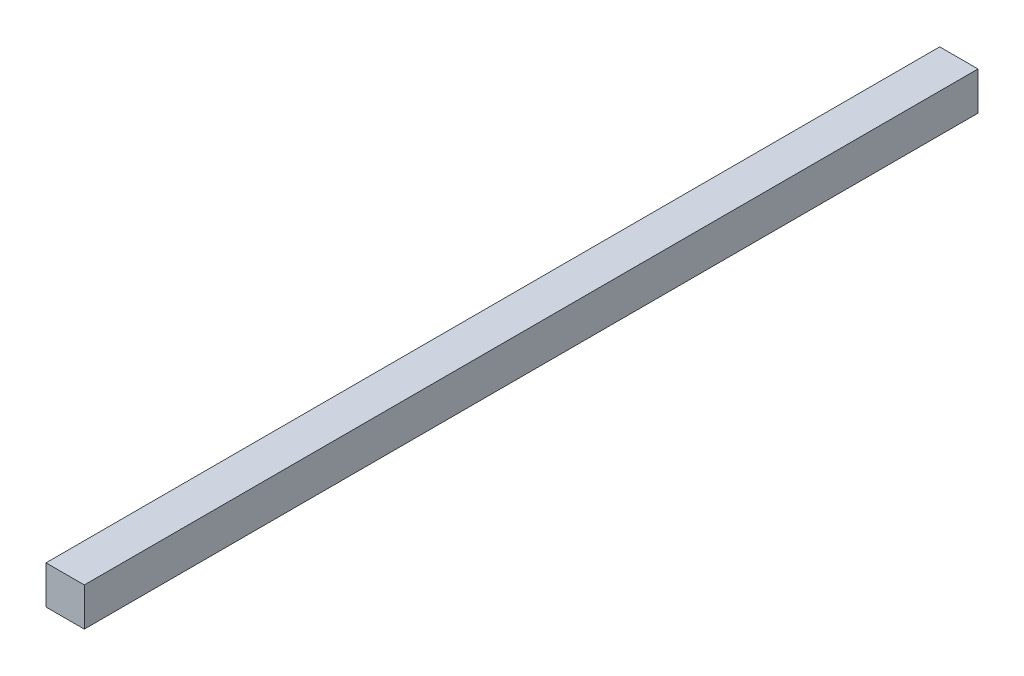
ISO-10303-21;
HEADER;
FILE_DESCRIPTION(('STEP AP214'),'2;1');
FILE_NAME('part.step','',(''),(''),'','','');
FILE_SCHEMA(('AUTOMOTIVE_DESIGN { 1 0 10303 214 1 1 1 1 }'));
ENDSEC;
DATA;
#1=APPLICATION_CONTEXT('core data for automotive mechanical design processes');
#2=APPLICATION_PROTOCOL_DEFINITION('international standard','automotive_design',2000,#1);
#3=PRODUCT_CONTEXT('',#1,'mechanical');
#4=PRODUCT('Part','Part','',(#3));
#5=PRODUCT_RELATED_PRODUCT_CATEGORY('part','',(#4));
#6=PRODUCT_DEFINITION_FORMATION('','',#4);
#7=PRODUCT_DEFINITION_CONTEXT('part definition',#1,'design');
#8=PRODUCT_DEFINITION('design','',#6,#7);
#9=PRODUCT_DEFINITION_SHAPE('','',#8);
#10=(LENGTH_UNIT() NAMED_UNIT(*) SI_UNIT(.MILLI.,.METRE.));
#11=(NAMED_UNIT(*) PLANE_ANGLE_UNIT() SI_UNIT($,.RADIAN.));
#12=(NAMED_UNIT(*) SI_UNIT($,.STERADIAN.) SOLID_ANGLE_UNIT());
#13=UNCERTAINTY_MEASURE_WITH_UNIT(LENGTH_MEASURE(1.E-05),#10,'distance_accuracy_value','');
#14=(GEOMETRIC_REPRESENTATION_CONTEXT(3) GLOBAL_UNCERTAINTY_ASSIGNED_CONTEXT((#13)) GLOBAL_UNIT_ASSIGNED_CONTEXT((#10,
#11,#12)) REPRESENTATION_CONTEXT('',''));
#15=CARTESIAN_POINT('',(0.,0.,0.));
#16=DIRECTION('',(0.,0.,1.));
#17=DIRECTION('',(1.,0.,0.));
#18=AXIS2_PLACEMENT_3D('',#15,#16,#17);
#19=CARTESIAN_POINT('',(7.5,-7.5,350.));
#20=DIRECTION('',(-1.,0.,0.));
#21=DIRECTION('',(0.,0.,1.));
#22=AXIS2_PLACEMENT_3D('',#19,#20,#21);
#23=PLANE('',#22);
#24=DIRECTION('',(0.,1.,0.));
#25=VECTOR('',#24,1.);
#26=CARTESIAN_POINT('',(7.5,-7.5,0.));
#27=LINE('',#26,#25);
#28=CARTESIAN_POINT('',(7.5,-7.5,0.));
#29=VERTEX_POINT('',#28);
#30=CARTESIAN_POINT('',(7.5,7.5,0.));
#31=VERTEX_POINT('',#30);
#32=EDGE_CURVE('E97',#29,#31,#27,.T.);
#33=ORIENTED_EDGE('',*,*,#32,.T.);
#34=DIRECTION('',(0.,0.,-1.));
#35=VECTOR('',#34,1.);
#36=CARTESIAN_POINT('',(7.5,7.5,350.));
#37=LINE('',#36,#35);
#38=CARTESIAN_POINT('',(7.5,7.5,350.));
#39=VERTEX_POINT('',#38);
#40=EDGE_CURVE('E11',#39,#31,#37,.T.);
#41=ORIENTED_EDGE('',*,*,#40,.F.);
#42=DIRECTION('',(0.,1.,0.));
#43=VECTOR('',#42,1.);
#44=CARTESIAN_POINT('',(7.5,-7.5,350.));
#45=LINE('',#44,#43);
#46=CARTESIAN_POINT('',(7.5,-7.5,350.));
#47=VERTEX_POINT('',#46);
#48=EDGE_CURVE('E85',#47,#39,#45,.T.);
#49=ORIENTED_EDGE('',*,*,#48,.F.);
#50=DIRECTION('',(0.,0.,-1.));
#51=VECTOR('',#50,1.);
#52=CARTESIAN_POINT('',(7.5,-7.5,350.));
#53=LINE('',#52,#51);
#54=EDGE_CURVE('E93',#47,#29,#53,.T.);
#55=ORIENTED_EDGE('',*,*,#54,.T.);
#56=EDGE_LOOP('',(#33,#41,#49,#55));
#57=FACE_BOUND('',#56,.T.);
#58=ADVANCED_FACE('F34',(#57),#23,.F.);
#59=CARTESIAN_POINT('',(-7.5,7.5,350.));
#60=DIRECTION('',(0.,-1.,0.));
#61=DIRECTION('',(0.,0.,-1.));
#62=AXIS2_PLACEMENT_3D('',#59,#60,#61);
#63=PLANE('',#62);
#64=DIRECTION('',(-1.,0.,0.));
#65=VECTOR('',#64,1.);
#66=CARTESIAN_POINT('',(-7.5,7.5,0.));
#67=LINE('',#66,#65);
#68=CARTESIAN_POINT('',(-7.5,7.5,0.));
#69=VERTEX_POINT('',#68);
#70=EDGE_CURVE('E89',#31,#69,#67,.T.);
#71=ORIENTED_EDGE('',*,*,#70,.T.);
#72=DIRECTION('',(0.,0.,-1.));
#73=VECTOR('',#72,1.);
#74=CARTESIAN_POINT('',(-7.5,7.5,350.));
#75=LINE('',#74,#73);
#76=CARTESIAN_POINT('',(-7.5,7.5,350.));
#77=VERTEX_POINT('',#76);
#78=EDGE_CURVE('E42',#77,#69,#75,.T.);
#79=ORIENTED_EDGE('',*,*,#78,.F.);
#80=DIRECTION('',(-1.,0.,0.));
#81=VECTOR('',#80,1.);
#82=CARTESIAN_POINT('',(-7.5,7.5,350.));
#83=LINE('',#82,#81);
#84=EDGE_CURVE('E80',#39,#77,#83,.T.);
#85=ORIENTED_EDGE('',*,*,#84,.F.);
#86=ORIENTED_EDGE('',*,*,#40,.T.);
#87=EDGE_LOOP('',(#71,#79,#85,#86));
#88=FACE_BOUND('',#87,.T.);
#89=ADVANCED_FACE('F88',(#88),#63,.F.);
#90=CARTESIAN_POINT('',(-7.5,-7.5,350.));
#91=DIRECTION('',(1.,0.,0.));
#92=DIRECTION('',(0.,0.,-1.));
#93=AXIS2_PLACEMENT_3D('',#90,#91,#92);
#94=PLANE('',#93);
#95=DIRECTION('',(0.,-1.,0.));
#96=VECTOR('',#95,1.);
#97=CARTESIAN_POINT('',(-7.5,-7.5,0.));
#98=LINE('',#97,#96);
#99=CARTESIAN_POINT('',(-7.5,-7.5,0.));
#100=VERTEX_POINT('',#99);
#101=EDGE_CURVE('E67',#69,#100,#98,.T.);
#102=ORIENTED_EDGE('',*,*,#101,.T.);
#103=DIRECTION('',(0.,0.,-1.));
#104=VECTOR('',#103,1.);
#105=CARTESIAN_POINT('',(-7.5,-7.5,350.));
#106=LINE('',#105,#104);
#107=CARTESIAN_POINT('',(-7.5,-7.5,350.));
#108=VERTEX_POINT('',#107);
#109=EDGE_CURVE('E90',#108,#100,#106,.T.);
#110=ORIENTED_EDGE('',*,*,#109,.F.);
#111=DIRECTION('',(0.,-1.,0.));
#112=VECTOR('',#111,1.);
#113=CARTESIAN_POINT('',(-7.5,-7.5,350.));
#114=LINE('',#113,#112);
#115=EDGE_CURVE('E83',#77,#108,#114,.T.);
#116=ORIENTED_EDGE('',*,*,#115,.F.);
#117=ORIENTED_EDGE('',*,*,#78,.T.);
#118=EDGE_LOOP('',(#102,#110,#116,#117));
#119=FACE_BOUND('',#118,.T.);
#120=ADVANCED_FACE('F91',(#119),#94,.F.);
#121=CARTESIAN_POINT('',(-7.5,-7.5,350.));
#122=DIRECTION('',(0.,1.,0.));
#123=DIRECTION('',(0.,0.,1.));
#124=AXIS2_PLACEMENT_3D('',#121,#122,#123);
#125=PLANE('',#124);
#126=DIRECTION('',(1.,0.,0.));
#127=VECTOR('',#126,1.);
#128=CARTESIAN_POINT('',(-7.5,-7.5,0.));
#129=LINE('',#128,#127);
#130=EDGE_CURVE('E73',#100,#29,#129,.T.);
#131=ORIENTED_EDGE('',*,*,#130,.T.);
#132=ORIENTED_EDGE('',*,*,#54,.F.);
#133=DIRECTION('',(1.,0.,0.));
#134=VECTOR('',#133,1.);
#135=CARTESIAN_POINT('',(-7.5,-7.5,350.));
#136=LINE('',#135,#134);
#137=EDGE_CURVE('E50',#108,#47,#136,.T.);
#138=ORIENTED_EDGE('',*,*,#137,.F.);
#139=ORIENTED_EDGE('',*,*,#109,.T.);
#140=EDGE_LOOP('',(#131,#132,#138,#139));
#141=FACE_BOUND('',#140,.T.);
#142=ADVANCED_FACE('F104',(#141),#125,.F.);
#143=CARTESIAN_POINT('',(0.,0.,350.));
#144=DIRECTION('',(0.,0.,-1.));
#145=DIRECTION('',(-1.,0.,0.));
#146=AXIS2_PLACEMENT_3D('',#143,#144,#145);
#147=PLANE('',#146);
#148=ORIENTED_EDGE('',*,*,#48,.T.);
#149=ORIENTED_EDGE('',*,*,#84,.T.);
#150=ORIENTED_EDGE('',*,*,#115,.T.);
#151=ORIENTED_EDGE('',*,*,#137,.T.);
#152=EDGE_LOOP('',(#148,#149,#150,#151));
#153=FACE_BOUND('',#152,.T.);
#154=ADVANCED_FACE('F81',(#153),#147,.F.);
#155=CARTESIAN_POINT('',(0.,0.,0.));
#156=DIRECTION('',(0.,0.,-1.));
#157=DIRECTION('',(-1.,0.,0.));
#158=AXIS2_PLACEMENT_3D('',#155,#156,#157);
#159=PLANE('',#158);
#160=ORIENTED_EDGE('',*,*,#32,.F.);
#161=ORIENTED_EDGE('',*,*,#130,.F.);
#162=ORIENTED_EDGE('',*,*,#101,.F.);
#163=ORIENTED_EDGE('',*,*,#70,.F.);
#164=EDGE_LOOP('',(#160,#161,#162,#163));
#165=FACE_BOUND('',#164,.T.);
#166=ADVANCED_FACE('F107',(#165),#159,.T.);
#167=CLOSED_SHELL('',(#58,#89,#120,#142,#154,#166));
#168=MANIFOLD_SOLID_BREP('B2',#167);
#169=ADVANCED_BREP_SHAPE_REPRESENTATION('',(#18,#168),#14);
#170=SHAPE_DEFINITION_REPRESENTATION(#9,#169);
ENDSEC;
END-ISO-10303-21;
